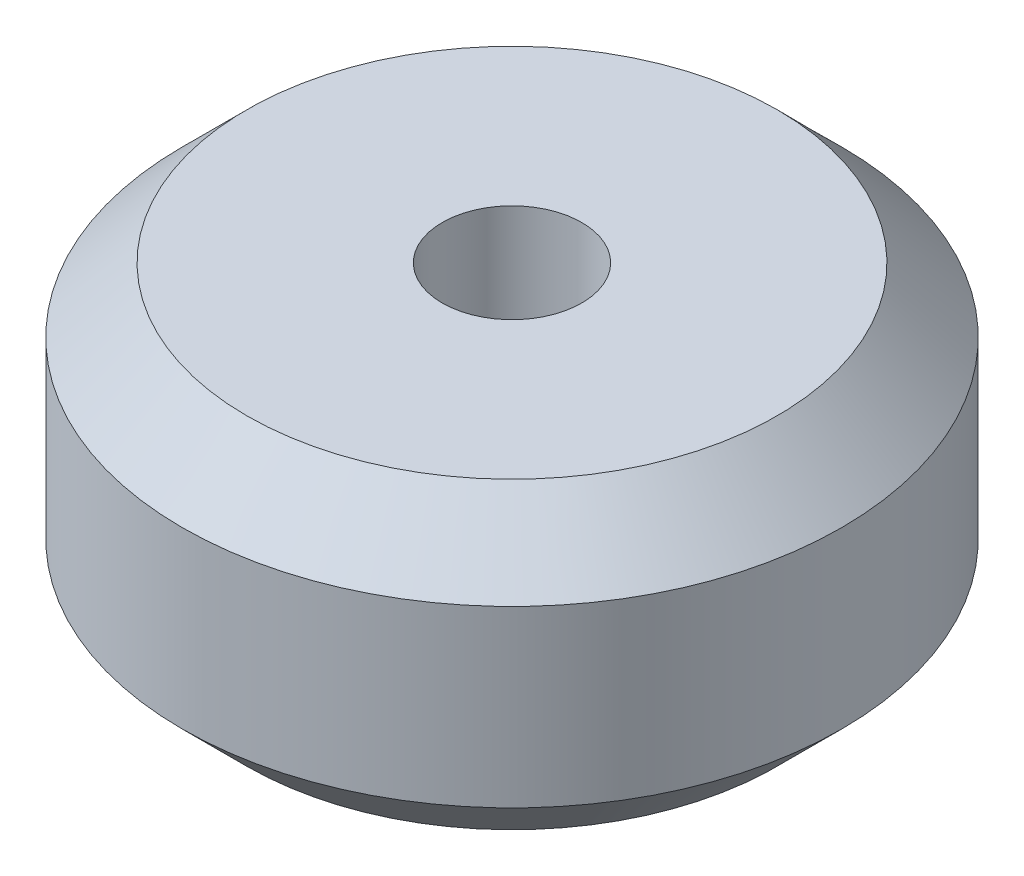
ISO-10303-21;
HEADER;
FILE_DESCRIPTION(('STEP AP214'),'2;1');
FILE_NAME('part.step','',(''),(''),'','','');
FILE_SCHEMA(('AUTOMOTIVE_DESIGN { 1 0 10303 214 1 1 1 1 }'));
ENDSEC;
DATA;
#1=APPLICATION_CONTEXT('core data for automotive mechanical design processes');
#2=APPLICATION_PROTOCOL_DEFINITION('international standard','automotive_design',2000,#1);
#3=PRODUCT_CONTEXT('',#1,'mechanical');
#4=PRODUCT('Part','Part','',(#3));
#5=PRODUCT_RELATED_PRODUCT_CATEGORY('part','',(#4));
#6=PRODUCT_DEFINITION_FORMATION('','',#4);
#7=PRODUCT_DEFINITION_CONTEXT('part definition',#1,'design');
#8=PRODUCT_DEFINITION('design','',#6,#7);
#9=PRODUCT_DEFINITION_SHAPE('','',#8);
#10=(LENGTH_UNIT() NAMED_UNIT(*) SI_UNIT(.MILLI.,.METRE.));
#11=(NAMED_UNIT(*) PLANE_ANGLE_UNIT() SI_UNIT($,.RADIAN.));
#12=(NAMED_UNIT(*) SI_UNIT($,.STERADIAN.) SOLID_ANGLE_UNIT());
#13=UNCERTAINTY_MEASURE_WITH_UNIT(LENGTH_MEASURE(1.E-05),#10,'distance_accuracy_value','');
#14=(GEOMETRIC_REPRESENTATION_CONTEXT(3) GLOBAL_UNCERTAINTY_ASSIGNED_CONTEXT((#13)) GLOBAL_UNIT_ASSIGNED_CONTEXT((#10,
#11,#12)) REPRESENTATION_CONTEXT('',''));
#15=CARTESIAN_POINT('',(0.,0.,0.));
#16=DIRECTION('',(0.,0.,1.));
#17=DIRECTION('',(1.,0.,0.));
#18=AXIS2_PLACEMENT_3D('',#15,#16,#17);
#19=CARTESIAN_POINT('',(9.652,5.5245,0.));
#20=DIRECTION('',(0.,-1.,0.));
#21=DIRECTION('',(0.,0.,-1.));
#22=AXIS2_PLACEMENT_3D('',#19,#20,#21);
#23=PLANE('',#22);
#24=CARTESIAN_POINT('',(0.,5.5245,0.));
#25=DIRECTION('',(0.,1.,0.));
#26=DIRECTION('',(0.,0.,1.));
#27=AXIS2_PLACEMENT_3D('',#24,#25,#26);
#28=CIRCLE('',#27,2.54);
#29=CARTESIAN_POINT('',(0.,5.5245,2.54));
#30=VERTEX_POINT('',#29);
#31=EDGE_CURVE('E10',#30,#30,#28,.T.);
#32=ORIENTED_EDGE('',*,*,#31,.F.);
#33=EDGE_LOOP('',(#32));
#34=FACE_BOUND('',#33,.T.);
#35=CARTESIAN_POINT('',(0.,5.5245,0.));
#36=DIRECTION('',(0.,1.,0.));
#37=DIRECTION('',(0.,0.,1.));
#38=AXIS2_PLACEMENT_3D('',#35,#36,#37);
#39=CIRCLE('',#38,9.652);
#40=CARTESIAN_POINT('',(0.,5.5245,9.652));
#41=VERTEX_POINT('',#40);
#42=EDGE_CURVE('E64',#41,#41,#39,.T.);
#43=ORIENTED_EDGE('',*,*,#42,.T.);
#44=EDGE_LOOP('',(#43));
#45=FACE_BOUND('',#44,.T.);
#46=ADVANCED_FACE('F36',(#34,#45),#23,.F.);
#47=CARTESIAN_POINT('',(0.,5.5245,0.));
#48=DIRECTION('',(0.,1.,0.));
#49=DIRECTION('',(0.,0.,1.));
#50=AXIS2_PLACEMENT_3D('',#47,#48,#49);
#51=CYLINDRICAL_SURFACE('',#50,2.54);
#52=CARTESIAN_POINT('',(0.,-5.5245,0.));
#53=DIRECTION('',(0.,1.,0.));
#54=DIRECTION('',(0.,0.,1.));
#55=AXIS2_PLACEMENT_3D('',#52,#53,#54);
#56=CIRCLE('',#55,2.54);
#57=CARTESIAN_POINT('',(0.,-5.5245,2.54));
#58=VERTEX_POINT('',#57);
#59=EDGE_CURVE('E43',#58,#58,#56,.T.);
#60=ORIENTED_EDGE('',*,*,#59,.F.);
#61=EDGE_LOOP('',(#60));
#62=FACE_BOUND('',#61,.T.);
#63=ORIENTED_EDGE('',*,*,#31,.T.);
#64=EDGE_LOOP('',(#63));
#65=FACE_BOUND('',#64,.T.);
#66=ADVANCED_FACE('F89',(#62,#65),#51,.F.);
#67=CARTESIAN_POINT('',(2.54,-5.5245,0.));
#68=DIRECTION('',(0.,1.,0.));
#69=DIRECTION('',(0.,0.,1.));
#70=AXIS2_PLACEMENT_3D('',#67,#68,#69);
#71=PLANE('',#70);
#72=CARTESIAN_POINT('',(0.,-5.5245,0.));
#73=DIRECTION('',(0.,1.,0.));
#74=DIRECTION('',(0.,0.,1.));
#75=AXIS2_PLACEMENT_3D('',#72,#73,#74);
#76=CIRCLE('',#75,9.652);
#77=CARTESIAN_POINT('',(0.,-5.5245,9.652));
#78=VERTEX_POINT('',#77);
#79=EDGE_CURVE('E49',#78,#78,#76,.T.);
#80=ORIENTED_EDGE('',*,*,#79,.F.);
#81=EDGE_LOOP('',(#80));
#82=FACE_BOUND('',#81,.T.);
#83=ORIENTED_EDGE('',*,*,#59,.T.);
#84=EDGE_LOOP('',(#83));
#85=FACE_BOUND('',#84,.T.);
#86=ADVANCED_FACE('F84',(#82,#85),#71,.F.);
#87=CARTESIAN_POINT('',(0.,-5.5245,0.));
#88=DIRECTION('',(0.,1.,0.));
#89=DIRECTION('',(0.,0.,1.));
#90=AXIS2_PLACEMENT_3D('',#87,#88,#89);
#91=CONICAL_SURFACE('',#90,9.652,0.785398163397448);
#92=CARTESIAN_POINT('',(0.,-3.175,0.));
#93=DIRECTION('',(0.,1.,0.));
#94=DIRECTION('',(0.,0.,1.));
#95=AXIS2_PLACEMENT_3D('',#92,#93,#94);
#96=CIRCLE('',#95,12.0015);
#97=CARTESIAN_POINT('',(0.,-3.175,12.0015));
#98=VERTEX_POINT('',#97);
#99=EDGE_CURVE('E56',#98,#98,#96,.T.);
#100=ORIENTED_EDGE('',*,*,#99,.F.);
#101=EDGE_LOOP('',(#100));
#102=FACE_BOUND('',#101,.T.);
#103=ORIENTED_EDGE('',*,*,#79,.T.);
#104=EDGE_LOOP('',(#103));
#105=FACE_BOUND('',#104,.T.);
#106=ADVANCED_FACE('F78',(#102,#105),#91,.T.);
#107=CARTESIAN_POINT('',(0.,5.5245,0.));
#108=DIRECTION('',(0.,1.,0.));
#109=DIRECTION('',(0.,0.,1.));
#110=AXIS2_PLACEMENT_3D('',#107,#108,#109);
#111=CYLINDRICAL_SURFACE('',#110,12.0015);
#112=CARTESIAN_POINT('',(0.,3.175,0.));
#113=DIRECTION('',(0.,1.,0.));
#114=DIRECTION('',(0.,0.,1.));
#115=AXIS2_PLACEMENT_3D('',#112,#113,#114);
#116=CIRCLE('',#115,12.0015);
#117=CARTESIAN_POINT('',(0.,3.175,12.0015));
#118=VERTEX_POINT('',#117);
#119=EDGE_CURVE('E61',#118,#118,#116,.T.);
#120=ORIENTED_EDGE('',*,*,#119,.F.);
#121=EDGE_LOOP('',(#120));
#122=FACE_BOUND('',#121,.T.);
#123=ORIENTED_EDGE('',*,*,#99,.T.);
#124=EDGE_LOOP('',(#123));
#125=FACE_BOUND('',#124,.T.);
#126=ADVANCED_FACE('F72',(#122,#125),#111,.T.);
#127=CARTESIAN_POINT('',(0.,3.175,0.));
#128=DIRECTION('',(0.,-1.,0.));
#129=DIRECTION('',(0.,0.,-1.));
#130=AXIS2_PLACEMENT_3D('',#127,#128,#129);
#131=CONICAL_SURFACE('',#130,12.0015,0.785398163397448);
#132=ORIENTED_EDGE('',*,*,#42,.F.);
#133=EDGE_LOOP('',(#132));
#134=FACE_BOUND('',#133,.T.);
#135=ORIENTED_EDGE('',*,*,#119,.T.);
#136=EDGE_LOOP('',(#135));
#137=FACE_BOUND('',#136,.T.);
#138=ADVANCED_FACE('F69',(#134,#137),#131,.T.);
#139=CLOSED_SHELL('',(#46,#66,#86,#106,#126,#138));
#140=MANIFOLD_SOLID_BREP('B2',#139);
#141=ADVANCED_BREP_SHAPE_REPRESENTATION('',(#18,#140),#14);
#142=SHAPE_DEFINITION_REPRESENTATION(#9,#141);
ENDSEC;
END-ISO-10303-21;
